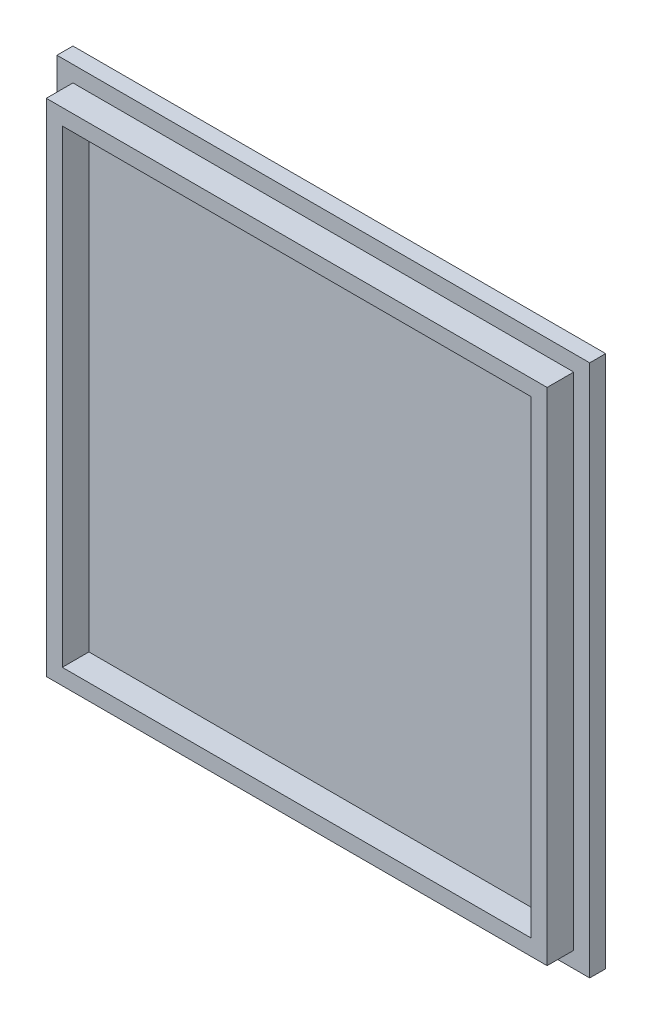
ISO-10303-21;
HEADER;
FILE_DESCRIPTION(('STEP AP214'),'2;1');
FILE_NAME('part.step','',(''),(''),'','','');
FILE_SCHEMA(('AUTOMOTIVE_DESIGN { 1 0 10303 214 1 1 1 1 }'));
ENDSEC;
DATA;
#1=APPLICATION_CONTEXT('core data for automotive mechanical design processes');
#2=APPLICATION_PROTOCOL_DEFINITION('international standard','automotive_design',2000,#1);
#3=PRODUCT_CONTEXT('',#1,'mechanical');
#4=PRODUCT('Part','Part','',(#3));
#5=PRODUCT_RELATED_PRODUCT_CATEGORY('part','',(#4));
#6=PRODUCT_DEFINITION_FORMATION('','',#4);
#7=PRODUCT_DEFINITION_CONTEXT('part definition',#1,'design');
#8=PRODUCT_DEFINITION('design','',#6,#7);
#9=PRODUCT_DEFINITION_SHAPE('','',#8);
#10=(LENGTH_UNIT() NAMED_UNIT(*) SI_UNIT(.MILLI.,.METRE.));
#11=(NAMED_UNIT(*) PLANE_ANGLE_UNIT() SI_UNIT($,.RADIAN.));
#12=(NAMED_UNIT(*) SI_UNIT($,.STERADIAN.) SOLID_ANGLE_UNIT());
#13=UNCERTAINTY_MEASURE_WITH_UNIT(LENGTH_MEASURE(1.E-05),#10,'distance_accuracy_value','');
#14=(GEOMETRIC_REPRESENTATION_CONTEXT(3) GLOBAL_UNCERTAINTY_ASSIGNED_CONTEXT((#13)) GLOBAL_UNIT_ASSIGNED_CONTEXT((#10,
#11,#12)) REPRESENTATION_CONTEXT('',''));
#15=CARTESIAN_POINT('',(0.,0.,0.));
#16=DIRECTION('',(0.,0.,1.));
#17=DIRECTION('',(1.,0.,0.));
#18=AXIS2_PLACEMENT_3D('',#15,#16,#17);
#19=CARTESIAN_POINT('',(-48.5411140583565,-47.4801061007969,8.));
#20=DIRECTION('',(1.,0.,0.));
#21=DIRECTION('',(0.,0.,-1.));
#22=AXIS2_PLACEMENT_3D('',#19,#20,#21);
#23=PLANE('',#22);
#24=DIRECTION('',(0.,-1.,0.));
#25=VECTOR('',#24,1.);
#26=CARTESIAN_POINT('',(-48.5411140583565,0.,3.));
#27=LINE('',#26,#25);
#28=CARTESIAN_POINT('',(-48.5411140583565,52.5198938992031,3.));
#29=VERTEX_POINT('',#28);
#30=CARTESIAN_POINT('',(-48.5411140583565,-47.4801061007969,3.));
#31=VERTEX_POINT('',#30);
#32=EDGE_CURVE('E197',#29,#31,#27,.T.);
#33=ORIENTED_EDGE('',*,*,#32,.F.);
#34=DIRECTION('',(0.,0.,-1.));
#35=VECTOR('',#34,1.);
#36=CARTESIAN_POINT('',(-48.5411140583565,52.5198938992031,8.));
#37=LINE('',#36,#35);
#38=CARTESIAN_POINT('',(-48.5411140583565,52.5198938992031,0.));
#39=VERTEX_POINT('',#38);
#40=EDGE_CURVE('E234',#29,#39,#37,.T.);
#41=ORIENTED_EDGE('',*,*,#40,.T.);
#42=DIRECTION('',(0.,-1.,0.));
#43=VECTOR('',#42,1.);
#44=CARTESIAN_POINT('',(-48.5411140583565,-47.4801061007969,0.));
#45=LINE('',#44,#43);
#46=CARTESIAN_POINT('',(-48.5411140583565,-47.4801061007969,0.));
#47=VERTEX_POINT('',#46);
#48=EDGE_CURVE('E216',#39,#47,#45,.T.);
#49=ORIENTED_EDGE('',*,*,#48,.T.);
#50=DIRECTION('',(0.,0.,-1.));
#51=VECTOR('',#50,1.);
#52=CARTESIAN_POINT('',(-48.5411140583565,-47.4801061007969,8.));
#53=LINE('',#52,#51);
#54=EDGE_CURVE('E12',#31,#47,#53,.T.);
#55=ORIENTED_EDGE('',*,*,#54,.F.);
#56=EDGE_LOOP('',(#33,#41,#49,#55));
#57=FACE_BOUND('',#56,.T.);
#58=ADVANCED_FACE('F59',(#57),#23,.F.);
#59=CARTESIAN_POINT('',(51.4588859416445,-47.4801061007969,8.));
#60=DIRECTION('',(0.,1.,0.));
#61=DIRECTION('',(-1.,0.,0.));
#62=AXIS2_PLACEMENT_3D('',#59,#60,#61);
#63=PLANE('',#62);
#64=DIRECTION('',(1.,0.,0.));
#65=VECTOR('',#64,1.);
#66=CARTESIAN_POINT('',(0.,-47.4801061007969,3.));
#67=LINE('',#66,#65);
#68=CARTESIAN_POINT('',(51.4588859416445,-47.4801061007969,3.));
#69=VERTEX_POINT('',#68);
#70=EDGE_CURVE('E199',#31,#69,#67,.T.);
#71=ORIENTED_EDGE('',*,*,#70,.F.);
#72=ORIENTED_EDGE('',*,*,#54,.T.);
#73=DIRECTION('',(1.,0.,0.));
#74=VECTOR('',#73,1.);
#75=CARTESIAN_POINT('',(51.4588859416445,-47.4801061007969,0.));
#76=LINE('',#75,#74);
#77=CARTESIAN_POINT('',(51.4588859416445,-47.4801061007969,0.));
#78=VERTEX_POINT('',#77);
#79=EDGE_CURVE('E225',#47,#78,#76,.T.);
#80=ORIENTED_EDGE('',*,*,#79,.T.);
#81=DIRECTION('',(0.,0.,-1.));
#82=VECTOR('',#81,1.);
#83=CARTESIAN_POINT('',(51.4588859416445,-47.4801061007969,8.));
#84=LINE('',#83,#82);
#85=EDGE_CURVE('E66',#69,#78,#84,.T.);
#86=ORIENTED_EDGE('',*,*,#85,.F.);
#87=EDGE_LOOP('',(#71,#72,#80,#86));
#88=FACE_BOUND('',#87,.T.);
#89=ADVANCED_FACE('F246',(#88),#63,.F.);
#90=CARTESIAN_POINT('',(51.4588859416435,52.5198938992031,8.));
#91=DIRECTION('',(-1.,0.,0.));
#92=DIRECTION('',(0.,-1.,0.));
#93=AXIS2_PLACEMENT_3D('',#90,#91,#92);
#94=PLANE('',#93);
#95=DIRECTION('',(0.,1.,0.));
#96=VECTOR('',#95,1.);
#97=CARTESIAN_POINT('',(51.458885941644,5.42742979942743E-13,3.));
#98=LINE('',#97,#96);
#99=CARTESIAN_POINT('',(51.4588859416435,52.5198938992031,3.));
#100=VERTEX_POINT('',#99);
#101=EDGE_CURVE('E73',#69,#100,#98,.T.);
#102=ORIENTED_EDGE('',*,*,#101,.F.);
#103=ORIENTED_EDGE('',*,*,#85,.T.);
#104=DIRECTION('',(0.,1.,0.));
#105=VECTOR('',#104,1.);
#106=CARTESIAN_POINT('',(51.4588859416435,52.5198938992031,0.));
#107=LINE('',#106,#105);
#108=CARTESIAN_POINT('',(51.4588859416435,52.5198938992031,0.));
#109=VERTEX_POINT('',#108);
#110=EDGE_CURVE('E228',#78,#109,#107,.T.);
#111=ORIENTED_EDGE('',*,*,#110,.T.);
#112=DIRECTION('',(0.,0.,-1.));
#113=VECTOR('',#112,1.);
#114=CARTESIAN_POINT('',(51.4588859416435,52.5198938992031,8.));
#115=LINE('',#114,#113);
#116=EDGE_CURVE('E236',#100,#109,#115,.T.);
#117=ORIENTED_EDGE('',*,*,#116,.F.);
#118=EDGE_LOOP('',(#102,#103,#111,#117));
#119=FACE_BOUND('',#118,.T.);
#120=ADVANCED_FACE('F239',(#119),#94,.F.);
#121=CARTESIAN_POINT('',(-48.5411140583565,52.5198938992031,8.));
#122=DIRECTION('',(0.,-1.,0.));
#123=DIRECTION('',(0.,0.,-1.));
#124=AXIS2_PLACEMENT_3D('',#121,#122,#123);
#125=PLANE('',#124);
#126=DIRECTION('',(-1.,0.,0.));
#127=VECTOR('',#126,1.);
#128=CARTESIAN_POINT('',(0.,52.5198938992031,3.));
#129=LINE('',#128,#127);
#130=EDGE_CURVE('E195',#100,#29,#129,.T.);
#131=ORIENTED_EDGE('',*,*,#130,.F.);
#132=ORIENTED_EDGE('',*,*,#116,.T.);
#133=DIRECTION('',(-1.,0.,0.));
#134=VECTOR('',#133,1.);
#135=CARTESIAN_POINT('',(-48.5411140583565,52.5198938992031,0.));
#136=LINE('',#135,#134);
#137=EDGE_CURVE('E231',#109,#39,#136,.T.);
#138=ORIENTED_EDGE('',*,*,#137,.T.);
#139=ORIENTED_EDGE('',*,*,#40,.F.);
#140=EDGE_LOOP('',(#131,#132,#138,#139));
#141=FACE_BOUND('',#140,.T.);
#142=ADVANCED_FACE('F253',(#141),#125,.F.);
#143=CARTESIAN_POINT('',(0.,0.,0.));
#144=DIRECTION('',(0.,0.,-1.));
#145=DIRECTION('',(-1.,0.,0.));
#146=AXIS2_PLACEMENT_3D('',#143,#144,#145);
#147=PLANE('',#146);
#148=ORIENTED_EDGE('',*,*,#48,.F.);
#149=ORIENTED_EDGE('',*,*,#137,.F.);
#150=ORIENTED_EDGE('',*,*,#110,.F.);
#151=ORIENTED_EDGE('',*,*,#79,.F.);
#152=EDGE_LOOP('',(#148,#149,#150,#151));
#153=FACE_BOUND('',#152,.T.);
#154=ADVANCED_FACE('F250',(#153),#147,.T.);
#155=CARTESIAN_POINT('',(0.,49.5198938992031,3.));
#156=DIRECTION('',(0.,1.,0.));
#157=DIRECTION('',(0.,0.,1.));
#158=AXIS2_PLACEMENT_3D('',#155,#156,#157);
#159=PLANE('',#158);
#160=DIRECTION('',(-1.,0.,0.));
#161=VECTOR('',#160,1.);
#162=CARTESIAN_POINT('',(0.,49.5198938992031,8.));
#163=LINE('',#162,#161);
#164=CARTESIAN_POINT('',(48.4588859416435,49.5198938992031,8.));
#165=VERTEX_POINT('',#164);
#166=CARTESIAN_POINT('',(-45.5411140583565,49.5198938992031,8.));
#167=VERTEX_POINT('',#166);
#168=EDGE_CURVE('E181',#165,#167,#163,.T.);
#169=ORIENTED_EDGE('',*,*,#168,.F.);
#170=DIRECTION('',(0.,0.,1.));
#171=VECTOR('',#170,1.);
#172=CARTESIAN_POINT('',(48.4588859416435,49.5198938992031,3.));
#173=LINE('',#172,#171);
#174=CARTESIAN_POINT('',(48.4588859416435,49.5198938992031,3.));
#175=VERTEX_POINT('',#174);
#176=EDGE_CURVE('E202',#175,#165,#173,.T.);
#177=ORIENTED_EDGE('',*,*,#176,.F.);
#178=DIRECTION('',(-1.,0.,0.));
#179=VECTOR('',#178,1.);
#180=CARTESIAN_POINT('',(0.,49.5198938992031,3.));
#181=LINE('',#180,#179);
#182=CARTESIAN_POINT('',(-45.5411140583565,49.5198938992031,3.));
#183=VERTEX_POINT('',#182);
#184=EDGE_CURVE('E185',#175,#183,#181,.T.);
#185=ORIENTED_EDGE('',*,*,#184,.T.);
#186=DIRECTION('',(0.,0.,1.));
#187=VECTOR('',#186,1.);
#188=CARTESIAN_POINT('',(-45.5411140583565,49.5198938992031,3.));
#189=LINE('',#188,#187);
#190=EDGE_CURVE('E213',#183,#167,#189,.T.);
#191=ORIENTED_EDGE('',*,*,#190,.T.);
#192=EDGE_LOOP('',(#169,#177,#185,#191));
#193=FACE_BOUND('',#192,.T.);
#194=ADVANCED_FACE('F270',(#193),#159,.T.);
#195=CARTESIAN_POINT('',(-45.5411140583565,0.,3.));
#196=DIRECTION('',(-1.,0.,0.));
#197=DIRECTION('',(0.,0.,1.));
#198=AXIS2_PLACEMENT_3D('',#195,#196,#197);
#199=PLANE('',#198);
#200=DIRECTION('',(0.,-1.,0.));
#201=VECTOR('',#200,1.);
#202=CARTESIAN_POINT('',(-45.5411140583565,0.,8.));
#203=LINE('',#202,#201);
#204=CARTESIAN_POINT('',(-45.5411140583565,-44.4801061007969,8.));
#205=VERTEX_POINT('',#204);
#206=EDGE_CURVE('E189',#167,#205,#203,.T.);
#207=ORIENTED_EDGE('',*,*,#206,.F.);
#208=ORIENTED_EDGE('',*,*,#190,.F.);
#209=DIRECTION('',(0.,-1.,0.));
#210=VECTOR('',#209,1.);
#211=CARTESIAN_POINT('',(-45.5411140583565,0.,3.));
#212=LINE('',#211,#210);
#213=CARTESIAN_POINT('',(-45.5411140583565,-44.4801061007969,3.));
#214=VERTEX_POINT('',#213);
#215=EDGE_CURVE('E193',#183,#214,#212,.T.);
#216=ORIENTED_EDGE('',*,*,#215,.T.);
#217=DIRECTION('',(0.,0.,1.));
#218=VECTOR('',#217,1.);
#219=CARTESIAN_POINT('',(-45.5411140583565,-44.4801061007969,3.));
#220=LINE('',#219,#218);
#221=EDGE_CURVE('E217',#214,#205,#220,.T.);
#222=ORIENTED_EDGE('',*,*,#221,.T.);
#223=EDGE_LOOP('',(#207,#208,#216,#222));
#224=FACE_BOUND('',#223,.T.);
#225=ADVANCED_FACE('F277',(#224),#199,.T.);
#226=CARTESIAN_POINT('',(0.,-44.4801061007969,3.));
#227=DIRECTION('',(0.,-1.,0.));
#228=DIRECTION('',(1.,0.,0.));
#229=AXIS2_PLACEMENT_3D('',#226,#227,#228);
#230=PLANE('',#229);
#231=DIRECTION('',(1.,0.,0.));
#232=VECTOR('',#231,1.);
#233=CARTESIAN_POINT('',(0.,-44.4801061007969,8.));
#234=LINE('',#233,#232);
#235=CARTESIAN_POINT('',(48.4588859416445,-44.4801061007969,8.));
#236=VERTEX_POINT('',#235);
#237=EDGE_CURVE('E208',#205,#236,#234,.T.);
#238=ORIENTED_EDGE('',*,*,#237,.F.);
#239=ORIENTED_EDGE('',*,*,#221,.F.);
#240=DIRECTION('',(1.,0.,0.));
#241=VECTOR('',#240,1.);
#242=CARTESIAN_POINT('',(0.,-44.4801061007969,3.));
#243=LINE('',#242,#241);
#244=CARTESIAN_POINT('',(48.4588859416445,-44.4801061007969,3.));
#245=VERTEX_POINT('',#244);
#246=EDGE_CURVE('E191',#214,#245,#243,.T.);
#247=ORIENTED_EDGE('',*,*,#246,.T.);
#248=DIRECTION('',(0.,0.,1.));
#249=VECTOR('',#248,1.);
#250=CARTESIAN_POINT('',(48.4588859416445,-44.4801061007969,3.));
#251=LINE('',#250,#249);
#252=EDGE_CURVE('E219',#245,#236,#251,.T.);
#253=ORIENTED_EDGE('',*,*,#252,.T.);
#254=EDGE_LOOP('',(#238,#239,#247,#253));
#255=FACE_BOUND('',#254,.T.);
#256=ADVANCED_FACE('F282',(#255),#230,.T.);
#257=CARTESIAN_POINT('',(48.458885941644,5.07953741399857E-13,3.));
#258=DIRECTION('',(1.,0.,0.));
#259=DIRECTION('',(0.,1.,0.));
#260=AXIS2_PLACEMENT_3D('',#257,#258,#259);
#261=PLANE('',#260);
#262=DIRECTION('',(0.,1.,0.));
#263=VECTOR('',#262,1.);
#264=CARTESIAN_POINT('',(48.458885941644,5.07953741399857E-13,8.));
#265=LINE('',#264,#263);
#266=EDGE_CURVE('E205',#236,#165,#265,.T.);
#267=ORIENTED_EDGE('',*,*,#266,.F.);
#268=ORIENTED_EDGE('',*,*,#252,.F.);
#269=DIRECTION('',(0.,1.,0.));
#270=VECTOR('',#269,1.);
#271=CARTESIAN_POINT('',(48.458885941644,5.07953741399857E-13,3.));
#272=LINE('',#271,#270);
#273=EDGE_CURVE('E188',#245,#175,#272,.T.);
#274=ORIENTED_EDGE('',*,*,#273,.T.);
#275=ORIENTED_EDGE('',*,*,#176,.T.);
#276=EDGE_LOOP('',(#267,#268,#274,#275));
#277=FACE_BOUND('',#276,.T.);
#278=ADVANCED_FACE('F279',(#277),#261,.T.);
#279=CARTESIAN_POINT('',(0.,0.,3.));
#280=DIRECTION('',(0.,0.,1.));
#281=DIRECTION('',(1.,0.,0.));
#282=AXIS2_PLACEMENT_3D('',#279,#280,#281);
#283=PLANE('',#282);
#284=ORIENTED_EDGE('',*,*,#184,.F.);
#285=ORIENTED_EDGE('',*,*,#273,.F.);
#286=ORIENTED_EDGE('',*,*,#246,.F.);
#287=ORIENTED_EDGE('',*,*,#215,.F.);
#288=EDGE_LOOP('',(#284,#285,#286,#287));
#289=FACE_BOUND('',#288,.T.);
#290=ORIENTED_EDGE('',*,*,#130,.T.);
#291=ORIENTED_EDGE('',*,*,#32,.T.);
#292=ORIENTED_EDGE('',*,*,#70,.T.);
#293=ORIENTED_EDGE('',*,*,#101,.T.);
#294=EDGE_LOOP('',(#290,#291,#292,#293));
#295=FACE_BOUND('',#294,.T.);
#296=ADVANCED_FACE('F255',(#289,#295),#283,.T.);
#297=CARTESIAN_POINT('',(0.,0.,8.));
#298=DIRECTION('',(0.,0.,-1.));
#299=DIRECTION('',(-1.,0.,0.));
#300=AXIS2_PLACEMENT_3D('',#297,#298,#299);
#301=PLANE('',#300);
#302=DIRECTION('',(0.,1.,0.));
#303=VECTOR('',#302,1.);
#304=CARTESIAN_POINT('',(45.458885941644,4.73151579808331E-13,8.));
#305=LINE('',#304,#303);
#306=CARTESIAN_POINT('',(45.4588859416444,-41.4801061007969,8.));
#307=VERTEX_POINT('',#306);
#308=CARTESIAN_POINT('',(45.4588859416435,46.5198938992031,8.));
#309=VERTEX_POINT('',#308);
#310=EDGE_CURVE('E175',#307,#309,#305,.T.);
#311=ORIENTED_EDGE('',*,*,#310,.F.);
#312=DIRECTION('',(1.,0.,0.));
#313=VECTOR('',#312,1.);
#314=CARTESIAN_POINT('',(0.,-41.4801061007969,8.));
#315=LINE('',#314,#313);
#316=CARTESIAN_POINT('',(-42.5411140583565,-41.4801061007969,8.));
#317=VERTEX_POINT('',#316);
#318=EDGE_CURVE('E81',#317,#307,#315,.T.);
#319=ORIENTED_EDGE('',*,*,#318,.F.);
#320=DIRECTION('',(0.,-1.,0.));
#321=VECTOR('',#320,1.);
#322=CARTESIAN_POINT('',(-42.5411140583565,0.,8.));
#323=LINE('',#322,#321);
#324=CARTESIAN_POINT('',(-42.5411140583565,46.5198938992031,8.));
#325=VERTEX_POINT('',#324);
#326=EDGE_CURVE('E166',#325,#317,#323,.T.);
#327=ORIENTED_EDGE('',*,*,#326,.F.);
#328=DIRECTION('',(-1.,0.,0.));
#329=VECTOR('',#328,1.);
#330=CARTESIAN_POINT('',(0.,46.5198938992031,8.));
#331=LINE('',#330,#329);
#332=EDGE_CURVE('E169',#309,#325,#331,.T.);
#333=ORIENTED_EDGE('',*,*,#332,.F.);
#334=EDGE_LOOP('',(#311,#319,#327,#333));
#335=FACE_BOUND('',#334,.T.);
#336=ORIENTED_EDGE('',*,*,#168,.T.);
#337=ORIENTED_EDGE('',*,*,#206,.T.);
#338=ORIENTED_EDGE('',*,*,#237,.T.);
#339=ORIENTED_EDGE('',*,*,#266,.T.);
#340=EDGE_LOOP('',(#336,#337,#338,#339));
#341=FACE_BOUND('',#340,.T.);
#342=ADVANCED_FACE('F271',(#335,#341),#301,.F.);
#343=CARTESIAN_POINT('',(0.,-41.4801061007969,3.));
#344=DIRECTION('',(0.,-1.,0.));
#345=DIRECTION('',(0.,0.,-1.));
#346=AXIS2_PLACEMENT_3D('',#343,#344,#345);
#347=PLANE('',#346);
#348=ORIENTED_EDGE('',*,*,#318,.T.);
#349=DIRECTION('',(0.,0.,1.));
#350=VECTOR('',#349,1.);
#351=CARTESIAN_POINT('',(45.4588859416444,-41.4801061007969,3.));
#352=LINE('',#351,#350);
#353=CARTESIAN_POINT('',(45.4588859416444,-41.4801061007969,3.));
#354=VERTEX_POINT('',#353);
#355=EDGE_CURVE('E144',#354,#307,#352,.T.);
#356=ORIENTED_EDGE('',*,*,#355,.F.);
#357=DIRECTION('',(1.,0.,0.));
#358=VECTOR('',#357,1.);
#359=CARTESIAN_POINT('',(0.,-41.4801061007969,3.));
#360=LINE('',#359,#358);
#361=CARTESIAN_POINT('',(-42.5411140583565,-41.4801061007969,3.));
#362=VERTEX_POINT('',#361);
#363=EDGE_CURVE('E148',#362,#354,#360,.T.);
#364=ORIENTED_EDGE('',*,*,#363,.F.);
#365=DIRECTION('',(0.,0.,1.));
#366=VECTOR('',#365,1.);
#367=CARTESIAN_POINT('',(-42.5411140583565,-41.4801061007969,3.));
#368=LINE('',#367,#366);
#369=EDGE_CURVE('E179',#362,#317,#368,.T.);
#370=ORIENTED_EDGE('',*,*,#369,.T.);
#371=EDGE_LOOP('',(#348,#356,#364,#370));
#372=FACE_BOUND('',#371,.T.);
#373=ADVANCED_FACE('F146',(#372),#347,.F.);
#374=CARTESIAN_POINT('',(-42.5411140583565,0.,3.));
#375=DIRECTION('',(-1.,0.,0.));
#376=DIRECTION('',(0.,0.,1.));
#377=AXIS2_PLACEMENT_3D('',#374,#375,#376);
#378=PLANE('',#377);
#379=ORIENTED_EDGE('',*,*,#326,.T.);
#380=ORIENTED_EDGE('',*,*,#369,.F.);
#381=DIRECTION('',(0.,-1.,0.));
#382=VECTOR('',#381,1.);
#383=CARTESIAN_POINT('',(-42.5411140583565,0.,3.));
#384=LINE('',#383,#382);
#385=CARTESIAN_POINT('',(-42.5411140583565,46.5198938992031,3.));
#386=VERTEX_POINT('',#385);
#387=EDGE_CURVE('E154',#386,#362,#384,.T.);
#388=ORIENTED_EDGE('',*,*,#387,.F.);
#389=DIRECTION('',(0.,0.,1.));
#390=VECTOR('',#389,1.);
#391=CARTESIAN_POINT('',(-42.5411140583565,46.5198938992031,3.));
#392=LINE('',#391,#390);
#393=EDGE_CURVE('E182',#386,#325,#392,.T.);
#394=ORIENTED_EDGE('',*,*,#393,.T.);
#395=EDGE_LOOP('',(#379,#380,#388,#394));
#396=FACE_BOUND('',#395,.T.);
#397=ADVANCED_FACE('F295',(#396),#378,.F.);
#398=CARTESIAN_POINT('',(0.,46.5198938992031,3.));
#399=DIRECTION('',(0.,1.,0.));
#400=DIRECTION('',(0.,0.,1.));
#401=AXIS2_PLACEMENT_3D('',#398,#399,#400);
#402=PLANE('',#401);
#403=ORIENTED_EDGE('',*,*,#332,.T.);
#404=ORIENTED_EDGE('',*,*,#393,.F.);
#405=DIRECTION('',(-1.,0.,0.));
#406=VECTOR('',#405,1.);
#407=CARTESIAN_POINT('',(0.,46.5198938992031,3.));
#408=LINE('',#407,#406);
#409=CARTESIAN_POINT('',(45.4588859416435,46.5198938992031,3.));
#410=VERTEX_POINT('',#409);
#411=EDGE_CURVE('E162',#410,#386,#408,.T.);
#412=ORIENTED_EDGE('',*,*,#411,.F.);
#413=DIRECTION('',(0.,0.,1.));
#414=VECTOR('',#413,1.);
#415=CARTESIAN_POINT('',(45.4588859416435,46.5198938992031,3.));
#416=LINE('',#415,#414);
#417=EDGE_CURVE('E153',#410,#309,#416,.T.);
#418=ORIENTED_EDGE('',*,*,#417,.T.);
#419=EDGE_LOOP('',(#403,#404,#412,#418));
#420=FACE_BOUND('',#419,.T.);
#421=ADVANCED_FACE('F298',(#420),#402,.F.);
#422=CARTESIAN_POINT('',(45.458885941644,4.73151579808331E-13,3.));
#423=DIRECTION('',(1.,0.,0.));
#424=DIRECTION('',(0.,1.,0.));
#425=AXIS2_PLACEMENT_3D('',#422,#423,#424);
#426=PLANE('',#425);
#427=ORIENTED_EDGE('',*,*,#310,.T.);
#428=ORIENTED_EDGE('',*,*,#417,.F.);
#429=DIRECTION('',(0.,1.,0.));
#430=VECTOR('',#429,1.);
#431=CARTESIAN_POINT('',(45.458885941644,4.73151579808331E-13,3.));
#432=LINE('',#431,#430);
#433=EDGE_CURVE('E157',#354,#410,#432,.T.);
#434=ORIENTED_EDGE('',*,*,#433,.F.);
#435=ORIENTED_EDGE('',*,*,#355,.T.);
#436=EDGE_LOOP('',(#427,#428,#434,#435));
#437=FACE_BOUND('',#436,.T.);
#438=ADVANCED_FACE('F158',(#437),#426,.F.);
#439=CARTESIAN_POINT('',(0.,0.,3.));
#440=DIRECTION('',(0.,0.,1.));
#441=DIRECTION('',(1.,0.,0.));
#442=AXIS2_PLACEMENT_3D('',#439,#440,#441);
#443=PLANE('',#442);
#444=ORIENTED_EDGE('',*,*,#363,.T.);
#445=ORIENTED_EDGE('',*,*,#433,.T.);
#446=ORIENTED_EDGE('',*,*,#411,.T.);
#447=ORIENTED_EDGE('',*,*,#387,.T.);
#448=EDGE_LOOP('',(#444,#445,#446,#447));
#449=FACE_BOUND('',#448,.T.);
#450=ADVANCED_FACE('F164',(#449),#443,.T.);
#451=CLOSED_SHELL('',(#58,#89,#120,#142,#154,#194,#225,#256,#278,#296,#342,#373,#397,#421,#438,#450));
#452=MANIFOLD_SOLID_BREP('B2',#451);
#453=ADVANCED_BREP_SHAPE_REPRESENTATION('',(#18,#452),#14);
#454=SHAPE_DEFINITION_REPRESENTATION(#9,#453);
ENDSEC;
END-ISO-10303-21;
